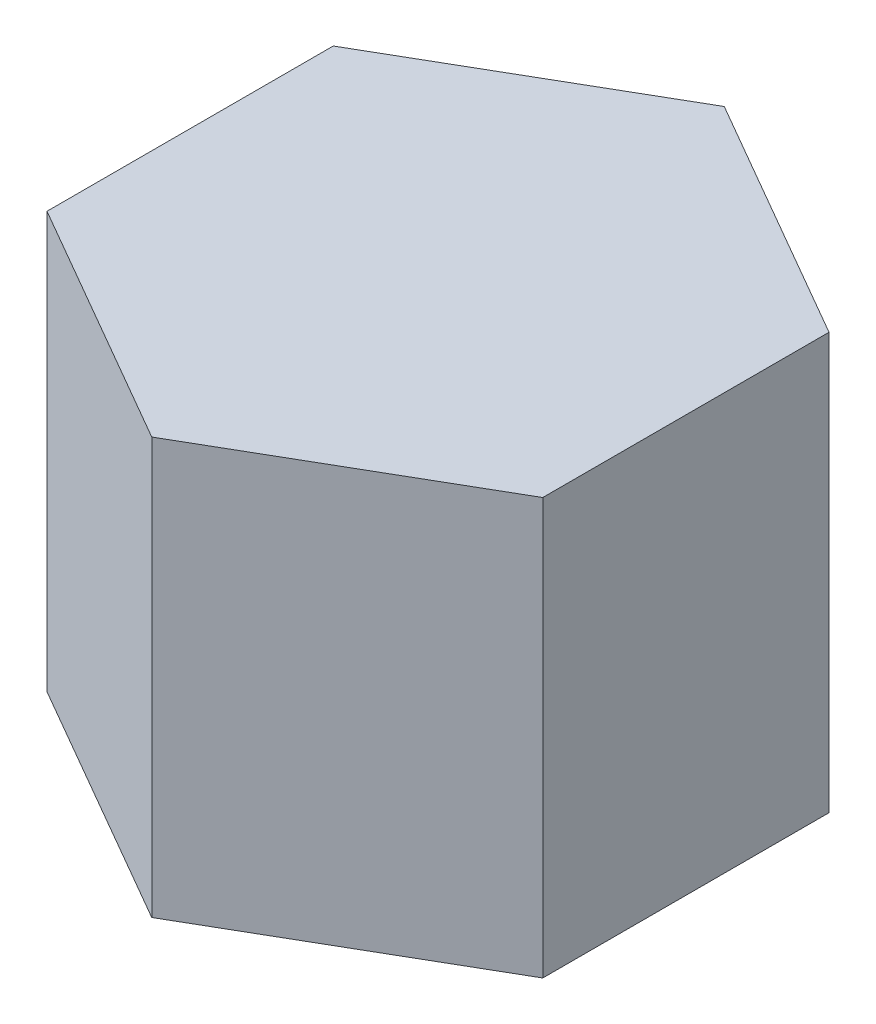
ISO-10303-21;
HEADER;
FILE_DESCRIPTION(('STEP AP214'),'2;1');
FILE_NAME('part.step','',(''),(''),'','','');
FILE_SCHEMA(('AUTOMOTIVE_DESIGN { 1 0 10303 214 1 1 1 1 }'));
ENDSEC;
DATA;
#1=APPLICATION_CONTEXT('core data for automotive mechanical design processes');
#2=APPLICATION_PROTOCOL_DEFINITION('international standard','automotive_design',2000,#1);
#3=PRODUCT_CONTEXT('',#1,'mechanical');
#4=PRODUCT('Part','Part','',(#3));
#5=PRODUCT_RELATED_PRODUCT_CATEGORY('part','',(#4));
#6=PRODUCT_DEFINITION_FORMATION('','',#4);
#7=PRODUCT_DEFINITION_CONTEXT('part definition',#1,'design');
#8=PRODUCT_DEFINITION('design','',#6,#7);
#9=PRODUCT_DEFINITION_SHAPE('','',#8);
#10=(LENGTH_UNIT() NAMED_UNIT(*) SI_UNIT(.MILLI.,.METRE.));
#11=(NAMED_UNIT(*) PLANE_ANGLE_UNIT() SI_UNIT($,.RADIAN.));
#12=(NAMED_UNIT(*) SI_UNIT($,.STERADIAN.) SOLID_ANGLE_UNIT());
#13=UNCERTAINTY_MEASURE_WITH_UNIT(LENGTH_MEASURE(1.E-05),#10,'distance_accuracy_value','');
#14=(GEOMETRIC_REPRESENTATION_CONTEXT(3) GLOBAL_UNCERTAINTY_ASSIGNED_CONTEXT((#13)) GLOBAL_UNIT_ASSIGNED_CONTEXT((#10,
#11,#12)) REPRESENTATION_CONTEXT('',''));
#15=CARTESIAN_POINT('',(0.,0.,0.));
#16=DIRECTION('',(0.,0.,1.));
#17=DIRECTION('',(1.,0.,0.));
#18=AXIS2_PLACEMENT_3D('',#15,#16,#17);
#19=CARTESIAN_POINT('',(206.339551417382,-147.556598747966,295.146072835632));
#20=DIRECTION('',(-0.500000000000096,0.,-0.866025403784383));
#21=DIRECTION('',(-0.866025403784383,0.,0.500000000000096));
#22=AXIS2_PLACEMENT_3D('',#19,#20,#21);
#23=PLANE('',#22);
#24=CARTESIAN_POINT('',(206.642660308706,-147.047793579175,294.971072835632));
#25=DIRECTION('',(-0.866025403784383,0.,0.500000000000096));
#26=VECTOR('',#25,1.);
#27=LINE('',#24,#26);
#28=CARTESIAN_POINT('',(206.642660308706,-147.047793579175,294.971072835632));
#29=VERTEX_POINT('',#28);
#30=CARTESIAN_POINT('',(206.339551417382,-147.047793579175,295.146072835632));
#31=VERTEX_POINT('',#30);
#32=EDGE_CURVE('E170',#29,#31,#27,.T.);
#33=ORIENTED_EDGE('',*,*,#32,.T.);
#34=CARTESIAN_POINT('',(206.339551417382,-147.556598747966,295.146072835632));
#35=DIRECTION('',(0.,1.,0.));
#36=VECTOR('',#35,1.);
#37=LINE('',#34,#36);
#38=CARTESIAN_POINT('',(206.339551417382,-147.556598747966,295.146072835632));
#39=VERTEX_POINT('',#38);
#40=EDGE_CURVE('E35',#39,#31,#37,.T.);
#41=ORIENTED_EDGE('',*,*,#40,.F.);
#42=CARTESIAN_POINT('',(206.642660308706,-147.556598747966,294.971072835632));
#43=DIRECTION('',(-0.866025403784383,0.,0.500000000000096));
#44=VECTOR('',#43,1.);
#45=LINE('',#42,#44);
#46=CARTESIAN_POINT('',(206.642660308706,-147.556598747966,294.971072835632));
#47=VERTEX_POINT('',#46);
#48=EDGE_CURVE('E159',#47,#39,#45,.T.);
#49=ORIENTED_EDGE('',*,*,#48,.F.);
#50=CARTESIAN_POINT('',(206.642660308706,-147.556598747966,294.971072835632));
#51=DIRECTION('',(0.,1.,0.));
#52=VECTOR('',#51,1.);
#53=LINE('',#50,#52);
#54=EDGE_CURVE('E10',#47,#29,#53,.T.);
#55=ORIENTED_EDGE('',*,*,#54,.T.);
#56=EDGE_LOOP('',(#33,#41,#49,#55));
#57=FACE_BOUND('',#56,.T.);
#58=ADVANCED_FACE('F16',(#57),#23,.F.);
#59=CARTESIAN_POINT('',(206.642660308706,-147.556598747966,291.594471220494));
#60=DIRECTION('',(-1.,0.,0.));
#61=DIRECTION('',(0.,-1.,0.));
#62=AXIS2_PLACEMENT_3D('',#59,#60,#61);
#63=PLANE('',#62);
#64=CARTESIAN_POINT('',(206.642660308706,-147.047793579175,294.621072835632));
#65=DIRECTION('',(0.,0.,1.));
#66=VECTOR('',#65,1.);
#67=LINE('',#64,#66);
#68=CARTESIAN_POINT('',(206.642660308706,-147.047793579175,294.621072835632));
#69=VERTEX_POINT('',#68);
#70=EDGE_CURVE('E167',#69,#29,#67,.T.);
#71=ORIENTED_EDGE('',*,*,#70,.T.);
#72=ORIENTED_EDGE('',*,*,#54,.F.);
#73=CARTESIAN_POINT('',(206.642660308706,-147.556598747966,294.621072835632));
#74=DIRECTION('',(0.,0.,1.));
#75=VECTOR('',#74,1.);
#76=LINE('',#73,#75);
#77=CARTESIAN_POINT('',(206.642660308706,-147.556598747966,294.621072835632));
#78=VERTEX_POINT('',#77);
#79=EDGE_CURVE('E156',#78,#47,#76,.T.);
#80=ORIENTED_EDGE('',*,*,#79,.F.);
#81=CARTESIAN_POINT('',(206.642660308706,-147.556598747966,294.621072835632));
#82=DIRECTION('',(0.,1.,0.));
#83=VECTOR('',#82,1.);
#84=LINE('',#81,#83);
#85=EDGE_CURVE('E27',#78,#69,#84,.T.);
#86=ORIENTED_EDGE('',*,*,#85,.T.);
#87=EDGE_LOOP('',(#71,#72,#80,#86));
#88=FACE_BOUND('',#87,.T.);
#89=ADVANCED_FACE('F189',(#88),#63,.F.);
#90=CARTESIAN_POINT('',(206.642660308706,-147.556598747966,294.621072835632));
#91=DIRECTION('',(-0.499999999999978,0.,0.866025403784452));
#92=DIRECTION('',(0.866025403784452,0.,0.499999999999978));
#93=AXIS2_PLACEMENT_3D('',#90,#91,#92);
#94=PLANE('',#93);
#95=CARTESIAN_POINT('',(206.339551417382,-147.047793579175,294.446072835632));
#96=DIRECTION('',(0.866025403784452,0.,0.499999999999978));
#97=VECTOR('',#96,1.);
#98=LINE('',#95,#97);
#99=CARTESIAN_POINT('',(206.339551417382,-147.047793579175,294.446072835632));
#100=VERTEX_POINT('',#99);
#101=EDGE_CURVE('E163',#100,#69,#98,.T.);
#102=ORIENTED_EDGE('',*,*,#101,.T.);
#103=ORIENTED_EDGE('',*,*,#85,.F.);
#104=CARTESIAN_POINT('',(206.339551417382,-147.556598747966,294.446072835632));
#105=DIRECTION('',(0.866025403784452,0.,0.499999999999978));
#106=VECTOR('',#105,1.);
#107=LINE('',#104,#106);
#108=CARTESIAN_POINT('',(206.339551417382,-147.556598747966,294.446072835632));
#109=VERTEX_POINT('',#108);
#110=EDGE_CURVE('E106',#109,#78,#107,.T.);
#111=ORIENTED_EDGE('',*,*,#110,.F.);
#112=CARTESIAN_POINT('',(206.339551417382,-147.556598747966,294.446072835632));
#113=DIRECTION('',(0.,1.,0.));
#114=VECTOR('',#113,1.);
#115=LINE('',#112,#114);
#116=EDGE_CURVE('E94',#109,#100,#115,.T.);
#117=ORIENTED_EDGE('',*,*,#116,.T.);
#118=EDGE_LOOP('',(#102,#103,#111,#117));
#119=FACE_BOUND('',#118,.T.);
#120=ADVANCED_FACE('F198',(#119),#94,.F.);
#121=CARTESIAN_POINT('',(206.339551417382,-147.556598747966,294.446072835632));
#122=DIRECTION('',(0.500000000000096,0.,0.866025403784383));
#123=DIRECTION('',(0.866025403784383,0.,-0.500000000000096));
#124=AXIS2_PLACEMENT_3D('',#121,#122,#123);
#125=PLANE('',#124);
#126=CARTESIAN_POINT('',(206.036442526057,-147.047793579175,294.621072835632));
#127=DIRECTION('',(0.866025403784383,0.,-0.500000000000096));
#128=VECTOR('',#127,1.);
#129=LINE('',#126,#128);
#130=CARTESIAN_POINT('',(206.036442526057,-147.047793579175,294.621072835632));
#131=VERTEX_POINT('',#130);
#132=EDGE_CURVE('E162',#131,#100,#129,.T.);
#133=ORIENTED_EDGE('',*,*,#132,.T.);
#134=ORIENTED_EDGE('',*,*,#116,.F.);
#135=CARTESIAN_POINT('',(206.036442526057,-147.556598747966,294.621072835632));
#136=DIRECTION('',(0.866025403784383,0.,-0.500000000000096));
#137=VECTOR('',#136,1.);
#138=LINE('',#135,#137);
#139=CARTESIAN_POINT('',(206.036442526057,-147.556598747966,294.621072835632));
#140=VERTEX_POINT('',#139);
#141=EDGE_CURVE('E98',#140,#109,#138,.T.);
#142=ORIENTED_EDGE('',*,*,#141,.F.);
#143=CARTESIAN_POINT('',(206.036442526057,-147.556598747966,294.621072835632));
#144=DIRECTION('',(0.,1.,0.));
#145=VECTOR('',#144,1.);
#146=LINE('',#143,#145);
#147=EDGE_CURVE('E79',#140,#131,#146,.T.);
#148=ORIENTED_EDGE('',*,*,#147,.T.);
#149=EDGE_LOOP('',(#133,#134,#142,#148));
#150=FACE_BOUND('',#149,.T.);
#151=ADVANCED_FACE('F100',(#150),#125,.F.);
#152=CARTESIAN_POINT('',(206.036442526057,-147.556598747966,291.594471220494));
#153=DIRECTION('',(1.,0.,0.));
#154=DIRECTION('',(0.,1.,0.));
#155=AXIS2_PLACEMENT_3D('',#152,#153,#154);
#156=PLANE('',#155);
#157=CARTESIAN_POINT('',(206.036442526057,-147.047793579175,294.971072835632));
#158=DIRECTION('',(0.,0.,-1.));
#159=VECTOR('',#158,1.);
#160=LINE('',#157,#159);
#161=CARTESIAN_POINT('',(206.036442526057,-147.047793579175,294.971072835632));
#162=VERTEX_POINT('',#161);
#163=EDGE_CURVE('E88',#162,#131,#160,.T.);
#164=ORIENTED_EDGE('',*,*,#163,.T.);
#165=ORIENTED_EDGE('',*,*,#147,.F.);
#166=CARTESIAN_POINT('',(206.036442526057,-147.556598747966,294.971072835632));
#167=DIRECTION('',(0.,0.,-1.));
#168=VECTOR('',#167,1.);
#169=LINE('',#166,#168);
#170=CARTESIAN_POINT('',(206.036442526057,-147.556598747966,294.971072835632));
#171=VERTEX_POINT('',#170);
#172=EDGE_CURVE('E84',#171,#140,#169,.T.);
#173=ORIENTED_EDGE('',*,*,#172,.F.);
#174=CARTESIAN_POINT('',(206.036442526057,-147.556598747966,294.971072835632));
#175=DIRECTION('',(0.,1.,0.));
#176=VECTOR('',#175,1.);
#177=LINE('',#174,#176);
#178=EDGE_CURVE('E58',#171,#162,#177,.T.);
#179=ORIENTED_EDGE('',*,*,#178,.T.);
#180=EDGE_LOOP('',(#164,#165,#173,#179));
#181=FACE_BOUND('',#180,.T.);
#182=ADVANCED_FACE('F82',(#181),#156,.F.);
#183=CARTESIAN_POINT('',(206.036442526057,-147.556598747966,294.971072835632));
#184=DIRECTION('',(0.500000000000062,0.,-0.866025403784403));
#185=DIRECTION('',(-0.866025403784403,0.,-0.500000000000062));
#186=AXIS2_PLACEMENT_3D('',#183,#184,#185);
#187=PLANE('',#186);
#188=CARTESIAN_POINT('',(206.339551417382,-147.047793579175,295.146072835632));
#189=DIRECTION('',(-0.866025403784403,0.,-0.500000000000062));
#190=VECTOR('',#189,1.);
#191=LINE('',#188,#190);
#192=EDGE_CURVE('E160',#31,#162,#191,.T.);
#193=ORIENTED_EDGE('',*,*,#192,.T.);
#194=ORIENTED_EDGE('',*,*,#178,.F.);
#195=CARTESIAN_POINT('',(206.339551417382,-147.556598747966,295.146072835632));
#196=DIRECTION('',(-0.866025403784403,0.,-0.500000000000062));
#197=VECTOR('',#196,1.);
#198=LINE('',#195,#197);
#199=EDGE_CURVE('E112',#39,#171,#198,.T.);
#200=ORIENTED_EDGE('',*,*,#199,.F.);
#201=ORIENTED_EDGE('',*,*,#40,.T.);
#202=EDGE_LOOP('',(#193,#194,#200,#201));
#203=FACE_BOUND('',#202,.T.);
#204=ADVANCED_FACE('F131',(#203),#187,.F.);
#205=CARTESIAN_POINT('',(206.491105863044,-147.556598747966,291.594471220494));
#206=DIRECTION('',(0.,1.,0.));
#207=DIRECTION('',(-1.,0.,0.));
#208=AXIS2_PLACEMENT_3D('',#205,#206,#207);
#209=PLANE('',#208);
#210=ORIENTED_EDGE('',*,*,#48,.T.);
#211=ORIENTED_EDGE('',*,*,#199,.T.);
#212=ORIENTED_EDGE('',*,*,#172,.T.);
#213=ORIENTED_EDGE('',*,*,#141,.T.);
#214=ORIENTED_EDGE('',*,*,#110,.T.);
#215=ORIENTED_EDGE('',*,*,#79,.T.);
#216=EDGE_LOOP('',(#210,#211,#212,#213,#214,#215));
#217=FACE_BOUND('',#216,.T.);
#218=ADVANCED_FACE('F111',(#217),#209,.F.);
#219=CARTESIAN_POINT('',(206.491105863044,-147.047793579175,291.594471220494));
#220=DIRECTION('',(0.,1.,0.));
#221=DIRECTION('',(-1.,0.,0.));
#222=AXIS2_PLACEMENT_3D('',#219,#220,#221);
#223=PLANE('',#222);
#224=ORIENTED_EDGE('',*,*,#32,.F.);
#225=ORIENTED_EDGE('',*,*,#70,.F.);
#226=ORIENTED_EDGE('',*,*,#101,.F.);
#227=ORIENTED_EDGE('',*,*,#132,.F.);
#228=ORIENTED_EDGE('',*,*,#163,.F.);
#229=ORIENTED_EDGE('',*,*,#192,.F.);
#230=EDGE_LOOP('',(#224,#225,#226,#227,#228,#229));
#231=FACE_BOUND('',#230,.T.);
#232=ADVANCED_FACE('F130',(#231),#223,.T.);
#233=CLOSED_SHELL('',(#58,#89,#120,#151,#182,#204,#218,#232));
#234=MANIFOLD_SOLID_BREP('B1',#233);
#235=ADVANCED_BREP_SHAPE_REPRESENTATION('',(#18,#234),#14);
#236=SHAPE_DEFINITION_REPRESENTATION(#9,#235);
ENDSEC;
END-ISO-10303-21;
